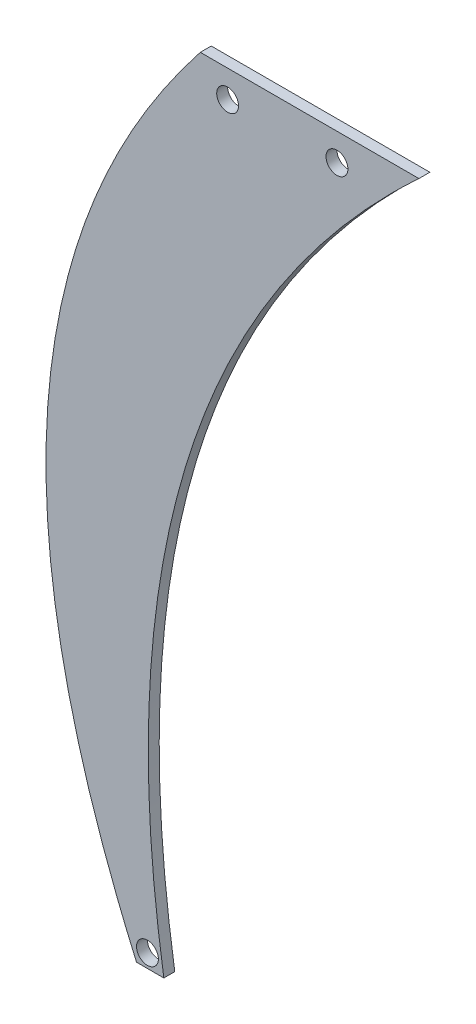
ISO-10303-21;
HEADER;
FILE_DESCRIPTION(('STEP AP214'),'2;1');
FILE_NAME('part.step','',(''),(''),'','','');
FILE_SCHEMA(('AUTOMOTIVE_DESIGN { 1 0 10303 214 1 1 1 1 }'));
ENDSEC;
DATA;
#1=APPLICATION_CONTEXT('core data for automotive mechanical design processes');
#2=APPLICATION_PROTOCOL_DEFINITION('international standard','automotive_design',2000,#1);
#3=PRODUCT_CONTEXT('',#1,'mechanical');
#4=PRODUCT('Part','Part','',(#3));
#5=PRODUCT_RELATED_PRODUCT_CATEGORY('part','',(#4));
#6=PRODUCT_DEFINITION_FORMATION('','',#4);
#7=PRODUCT_DEFINITION_CONTEXT('part definition',#1,'design');
#8=PRODUCT_DEFINITION('design','',#6,#7);
#9=PRODUCT_DEFINITION_SHAPE('','',#8);
#10=(LENGTH_UNIT() NAMED_UNIT(*) SI_UNIT(.MILLI.,.METRE.));
#11=(NAMED_UNIT(*) PLANE_ANGLE_UNIT() SI_UNIT($,.RADIAN.));
#12=(NAMED_UNIT(*) SI_UNIT($,.STERADIAN.) SOLID_ANGLE_UNIT());
#13=UNCERTAINTY_MEASURE_WITH_UNIT(LENGTH_MEASURE(1.E-05),#10,'distance_accuracy_value','');
#14=(GEOMETRIC_REPRESENTATION_CONTEXT(3) GLOBAL_UNCERTAINTY_ASSIGNED_CONTEXT((#13)) GLOBAL_UNIT_ASSIGNED_CONTEXT((#10,
#11,#12)) REPRESENTATION_CONTEXT('',''));
#15=CARTESIAN_POINT('',(0.,0.,0.));
#16=DIRECTION('',(0.,0.,1.));
#17=DIRECTION('',(1.,0.,0.));
#18=AXIS2_PLACEMENT_3D('',#15,#16,#17);
#19=CARTESIAN_POINT('',(0.,0.,2.));
#20=CARTESIAN_POINT('',(-49.8541136807412,-63.2359656220968,2.));
#21=CARTESIAN_POINT('',(-11.6702702702703,-150.,2.));
#22=B_SPLINE_CURVE_WITH_KNOTS('',2,(#19,#20,#21),.UNSPECIFIED.,.F.,.F.,(3,3),(0.,1.),.UNSPECIFIED.);
#23=DIRECTION('',(0.,0.,-1.));
#24=VECTOR('',#23,1.);
#25=SURFACE_OF_LINEAR_EXTRUSION('',#22,#24);
#26=CARTESIAN_POINT('',(0.,0.,0.));
#27=CARTESIAN_POINT('',(-49.8541136807412,-63.2359656220968,0.));
#28=CARTESIAN_POINT('',(-11.6702702702703,-150.,0.));
#29=B_SPLINE_CURVE_WITH_KNOTS('',2,(#26,#27,#28),.UNSPECIFIED.,.F.,.F.,(3,3),(0.,1.),.UNSPECIFIED.);
#30=CARTESIAN_POINT('',(0.,0.,0.));
#31=VERTEX_POINT('',#30);
#32=CARTESIAN_POINT('',(-11.6702702702703,-150.,0.));
#33=VERTEX_POINT('',#32);
#34=EDGE_CURVE('E119',#31,#33,#29,.T.);
#35=ORIENTED_EDGE('',*,*,#34,.T.);
#36=DIRECTION('',(0.,0.,-1.));
#37=VECTOR('',#36,1.);
#38=CARTESIAN_POINT('',(-11.6702702702703,-150.,2.));
#39=LINE('',#38,#37);
#40=CARTESIAN_POINT('',(-11.6702702702703,-150.,2.));
#41=VERTEX_POINT('',#40);
#42=EDGE_CURVE('E11',#41,#33,#39,.T.);
#43=ORIENTED_EDGE('',*,*,#42,.F.);
#44=CARTESIAN_POINT('',(0.,0.,2.));
#45=VERTEX_POINT('',#44);
#46=EDGE_CURVE('E88',#45,#41,#22,.T.);
#47=ORIENTED_EDGE('',*,*,#46,.F.);
#48=DIRECTION('',(0.,0.,-1.));
#49=VECTOR('',#48,1.);
#50=CARTESIAN_POINT('',(0.,0.,2.));
#51=LINE('',#50,#49);
#52=EDGE_CURVE('E96',#45,#31,#51,.T.);
#53=ORIENTED_EDGE('',*,*,#52,.T.);
#54=EDGE_LOOP('',(#35,#43,#47,#53));
#55=FACE_BOUND('',#54,.T.);
#56=ADVANCED_FACE('F36',(#55),#25,.F.);
#57=CARTESIAN_POINT('',(-11.6702702702703,-150.,2.));
#58=DIRECTION('',(0.,1.,0.));
#59=DIRECTION('',(0.,0.,1.));
#60=AXIS2_PLACEMENT_3D('',#57,#58,#59);
#61=PLANE('',#60);
#62=DIRECTION('',(1.,0.,0.));
#63=VECTOR('',#62,1.);
#64=CARTESIAN_POINT('',(-11.6702702702703,-150.,0.));
#65=LINE('',#64,#63);
#66=CARTESIAN_POINT('',(-6.67027027027029,-150.,0.));
#67=VERTEX_POINT('',#66);
#68=EDGE_CURVE('E92',#33,#67,#65,.T.);
#69=ORIENTED_EDGE('',*,*,#68,.T.);
#70=DIRECTION('',(0.,0.,-1.));
#71=VECTOR('',#70,1.);
#72=CARTESIAN_POINT('',(-6.67027027027029,-150.,2.));
#73=LINE('',#72,#71);
#74=CARTESIAN_POINT('',(-6.67027027027029,-150.,2.));
#75=VERTEX_POINT('',#74);
#76=EDGE_CURVE('E45',#75,#67,#73,.T.);
#77=ORIENTED_EDGE('',*,*,#76,.F.);
#78=DIRECTION('',(1.,0.,0.));
#79=VECTOR('',#78,1.);
#80=CARTESIAN_POINT('',(-11.6702702702703,-150.,2.));
#81=LINE('',#80,#79);
#82=EDGE_CURVE('E83',#41,#75,#81,.T.);
#83=ORIENTED_EDGE('',*,*,#82,.F.);
#84=ORIENTED_EDGE('',*,*,#42,.T.);
#85=EDGE_LOOP('',(#69,#77,#83,#84));
#86=FACE_BOUND('',#85,.T.);
#87=ADVANCED_FACE('F91',(#86),#61,.F.);
#88=CARTESIAN_POINT('',(-6.67027027027029,-150.,2.));
#89=CARTESIAN_POINT('',(-21.3893177837224,-56.8180645344432,2.));
#90=CARTESIAN_POINT('',(40.,0.,2.));
#91=B_SPLINE_CURVE_WITH_KNOTS('',2,(#88,#89,#90),.UNSPECIFIED.,.F.,.F.,(3,3),(0.,1.),.UNSPECIFIED.);
#92=DIRECTION('',(0.,0.,-1.));
#93=VECTOR('',#92,1.);
#94=SURFACE_OF_LINEAR_EXTRUSION('',#91,#93);
#95=CARTESIAN_POINT('',(-6.67027027027029,-150.,0.));
#96=CARTESIAN_POINT('',(-21.3893177837224,-56.8180645344432,0.));
#97=CARTESIAN_POINT('',(40.,0.,0.));
#98=B_SPLINE_CURVE_WITH_KNOTS('',2,(#95,#96,#97),.UNSPECIFIED.,.F.,.F.,(3,3),(0.,1.),.UNSPECIFIED.);
#99=CARTESIAN_POINT('',(40.,0.,0.));
#100=VERTEX_POINT('',#99);
#101=EDGE_CURVE('E70',#67,#100,#98,.T.);
#102=ORIENTED_EDGE('',*,*,#101,.T.);
#103=DIRECTION('',(0.,0.,-1.));
#104=VECTOR('',#103,1.);
#105=CARTESIAN_POINT('',(40.,0.,2.));
#106=LINE('',#105,#104);
#107=CARTESIAN_POINT('',(40.,0.,2.));
#108=VERTEX_POINT('',#107);
#109=EDGE_CURVE('E93',#108,#100,#106,.T.);
#110=ORIENTED_EDGE('',*,*,#109,.F.);
#111=EDGE_CURVE('E86',#75,#108,#91,.T.);
#112=ORIENTED_EDGE('',*,*,#111,.F.);
#113=ORIENTED_EDGE('',*,*,#76,.T.);
#114=EDGE_LOOP('',(#102,#110,#112,#113));
#115=FACE_BOUND('',#114,.T.);
#116=ADVANCED_FACE('F94',(#115),#94,.F.);
#117=CARTESIAN_POINT('',(0.,0.,2.));
#118=DIRECTION('',(0.,-1.,0.));
#119=DIRECTION('',(0.,0.,-1.));
#120=AXIS2_PLACEMENT_3D('',#117,#118,#119);
#121=PLANE('',#120);
#122=DIRECTION('',(-1.,0.,0.));
#123=VECTOR('',#122,1.);
#124=CARTESIAN_POINT('',(0.,0.,0.));
#125=LINE('',#124,#123);
#126=EDGE_CURVE('E76',#100,#31,#125,.T.);
#127=ORIENTED_EDGE('',*,*,#126,.T.);
#128=ORIENTED_EDGE('',*,*,#52,.F.);
#129=DIRECTION('',(-1.,0.,0.));
#130=VECTOR('',#129,1.);
#131=CARTESIAN_POINT('',(0.,0.,2.));
#132=LINE('',#131,#130);
#133=EDGE_CURVE('E53',#108,#45,#132,.T.);
#134=ORIENTED_EDGE('',*,*,#133,.F.);
#135=ORIENTED_EDGE('',*,*,#109,.T.);
#136=EDGE_LOOP('',(#127,#128,#134,#135));
#137=FACE_BOUND('',#136,.T.);
#138=ADVANCED_FACE('F108',(#137),#121,.F.);
#139=CARTESIAN_POINT('',(-27.8446244079382,-69.1179828110484,2.));
#140=DIRECTION('',(0.,0.,-1.));
#141=DIRECTION('',(-1.,0.,0.));
#142=AXIS2_PLACEMENT_3D('',#139,#140,#141);
#143=PLANE('',#142);
#144=CARTESIAN_POINT('',(-9.67027027027029,-147.5,2.));
#145=DIRECTION('',(0.,0.,1.));
#146=DIRECTION('',(1.,0.,0.));
#147=AXIS2_PLACEMENT_3D('',#144,#145,#146);
#148=CIRCLE('',#147,2.);
#149=CARTESIAN_POINT('',(-7.67027027027029,-147.5,2.));
#150=VERTEX_POINT('',#149);
#151=EDGE_CURVE('E169',#150,#150,#148,.T.);
#152=ORIENTED_EDGE('',*,*,#151,.F.);
#153=EDGE_LOOP('',(#152));
#154=FACE_BOUND('',#153,.T.);
#155=CARTESIAN_POINT('',(25.,-5.,2.));
#156=DIRECTION('',(0.,0.,1.));
#157=DIRECTION('',(1.,0.,0.));
#158=AXIS2_PLACEMENT_3D('',#155,#156,#157);
#159=CIRCLE('',#158,2.);
#160=CARTESIAN_POINT('',(27.,-5.,2.));
#161=VERTEX_POINT('',#160);
#162=EDGE_CURVE('E171',#161,#161,#159,.T.);
#163=ORIENTED_EDGE('',*,*,#162,.F.);
#164=EDGE_LOOP('',(#163));
#165=FACE_BOUND('',#164,.T.);
#166=CARTESIAN_POINT('',(5.,-5.,2.));
#167=DIRECTION('',(0.,0.,1.));
#168=DIRECTION('',(1.,0.,0.));
#169=AXIS2_PLACEMENT_3D('',#166,#167,#168);
#170=CIRCLE('',#169,2.);
#171=CARTESIAN_POINT('',(7.,-5.,2.));
#172=VERTEX_POINT('',#171);
#173=EDGE_CURVE('E124',#172,#172,#170,.T.);
#174=ORIENTED_EDGE('',*,*,#173,.F.);
#175=EDGE_LOOP('',(#174));
#176=FACE_BOUND('',#175,.T.);
#177=ORIENTED_EDGE('',*,*,#46,.T.);
#178=ORIENTED_EDGE('',*,*,#82,.T.);
#179=ORIENTED_EDGE('',*,*,#111,.T.);
#180=ORIENTED_EDGE('',*,*,#133,.T.);
#181=EDGE_LOOP('',(#177,#178,#179,#180));
#182=FACE_BOUND('',#181,.T.);
#183=ADVANCED_FACE('F84',(#154,#165,#176,#182),#143,.F.);
#184=CARTESIAN_POINT('',(-27.8446244079382,-69.1179828110484,0.));
#185=DIRECTION('',(0.,0.,-1.));
#186=DIRECTION('',(-1.,0.,0.));
#187=AXIS2_PLACEMENT_3D('',#184,#185,#186);
#188=PLANE('',#187);
#189=CARTESIAN_POINT('',(-9.67027027027029,-147.5,0.));
#190=DIRECTION('',(0.,0.,1.));
#191=DIRECTION('',(1.,0.,0.));
#192=AXIS2_PLACEMENT_3D('',#189,#190,#191);
#193=CIRCLE('',#192,2.);
#194=CARTESIAN_POINT('',(-7.67027027027029,-147.5,0.));
#195=VERTEX_POINT('',#194);
#196=EDGE_CURVE('E166',#195,#195,#193,.T.);
#197=ORIENTED_EDGE('',*,*,#196,.T.);
#198=EDGE_LOOP('',(#197));
#199=FACE_BOUND('',#198,.T.);
#200=CARTESIAN_POINT('',(25.,-5.,0.));
#201=DIRECTION('',(0.,0.,1.));
#202=DIRECTION('',(1.,0.,0.));
#203=AXIS2_PLACEMENT_3D('',#200,#201,#202);
#204=CIRCLE('',#203,2.);
#205=CARTESIAN_POINT('',(27.,-5.,0.));
#206=VERTEX_POINT('',#205);
#207=EDGE_CURVE('E174',#206,#206,#204,.T.);
#208=ORIENTED_EDGE('',*,*,#207,.T.);
#209=EDGE_LOOP('',(#208));
#210=FACE_BOUND('',#209,.T.);
#211=CARTESIAN_POINT('',(5.,-5.,0.));
#212=DIRECTION('',(0.,0.,1.));
#213=DIRECTION('',(1.,0.,0.));
#214=AXIS2_PLACEMENT_3D('',#211,#212,#213);
#215=CIRCLE('',#214,2.);
#216=CARTESIAN_POINT('',(7.,-5.,0.));
#217=VERTEX_POINT('',#216);
#218=EDGE_CURVE('E121',#217,#217,#215,.T.);
#219=ORIENTED_EDGE('',*,*,#218,.T.);
#220=EDGE_LOOP('',(#219));
#221=FACE_BOUND('',#220,.T.);
#222=ORIENTED_EDGE('',*,*,#34,.F.);
#223=ORIENTED_EDGE('',*,*,#126,.F.);
#224=ORIENTED_EDGE('',*,*,#101,.F.);
#225=ORIENTED_EDGE('',*,*,#68,.F.);
#226=EDGE_LOOP('',(#222,#223,#224,#225));
#227=FACE_BOUND('',#226,.T.);
#228=ADVANCED_FACE('F140',(#199,#210,#221,#227),#188,.T.);
#229=CARTESIAN_POINT('',(5.,-5.,0.));
#230=DIRECTION('',(0.,0.,1.));
#231=DIRECTION('',(1.,0.,0.));
#232=AXIS2_PLACEMENT_3D('',#229,#230,#231);
#233=CYLINDRICAL_SURFACE('',#232,2.);
#234=ORIENTED_EDGE('',*,*,#218,.F.);
#235=EDGE_LOOP('',(#234));
#236=FACE_BOUND('',#235,.T.);
#237=ORIENTED_EDGE('',*,*,#173,.T.);
#238=EDGE_LOOP('',(#237));
#239=FACE_BOUND('',#238,.T.);
#240=ADVANCED_FACE('F142',(#236,#239),#233,.F.);
#241=CARTESIAN_POINT('',(25.,-5.,0.));
#242=DIRECTION('',(0.,0.,1.));
#243=DIRECTION('',(1.,0.,0.));
#244=AXIS2_PLACEMENT_3D('',#241,#242,#243);
#245=CYLINDRICAL_SURFACE('',#244,2.);
#246=ORIENTED_EDGE('',*,*,#207,.F.);
#247=EDGE_LOOP('',(#246));
#248=FACE_BOUND('',#247,.T.);
#249=ORIENTED_EDGE('',*,*,#162,.T.);
#250=EDGE_LOOP('',(#249));
#251=FACE_BOUND('',#250,.T.);
#252=ADVANCED_FACE('F148',(#248,#251),#245,.F.);
#253=CARTESIAN_POINT('',(-9.67027027027029,-147.5,0.));
#254=DIRECTION('',(0.,0.,1.));
#255=DIRECTION('',(1.,0.,0.));
#256=AXIS2_PLACEMENT_3D('',#253,#254,#255);
#257=CYLINDRICAL_SURFACE('',#256,2.);
#258=ORIENTED_EDGE('',*,*,#196,.F.);
#259=EDGE_LOOP('',(#258));
#260=FACE_BOUND('',#259,.T.);
#261=ORIENTED_EDGE('',*,*,#151,.T.);
#262=EDGE_LOOP('',(#261));
#263=FACE_BOUND('',#262,.T.);
#264=ADVANCED_FACE('F158',(#260,#263),#257,.F.);
#265=CLOSED_SHELL('',(#56,#87,#116,#138,#183,#228,#240,#252,#264));
#266=MANIFOLD_SOLID_BREP('B2',#265);
#267=ADVANCED_BREP_SHAPE_REPRESENTATION('',(#18,#266),#14);
#268=SHAPE_DEFINITION_REPRESENTATION(#9,#267);
ENDSEC;
END-ISO-10303-21;
